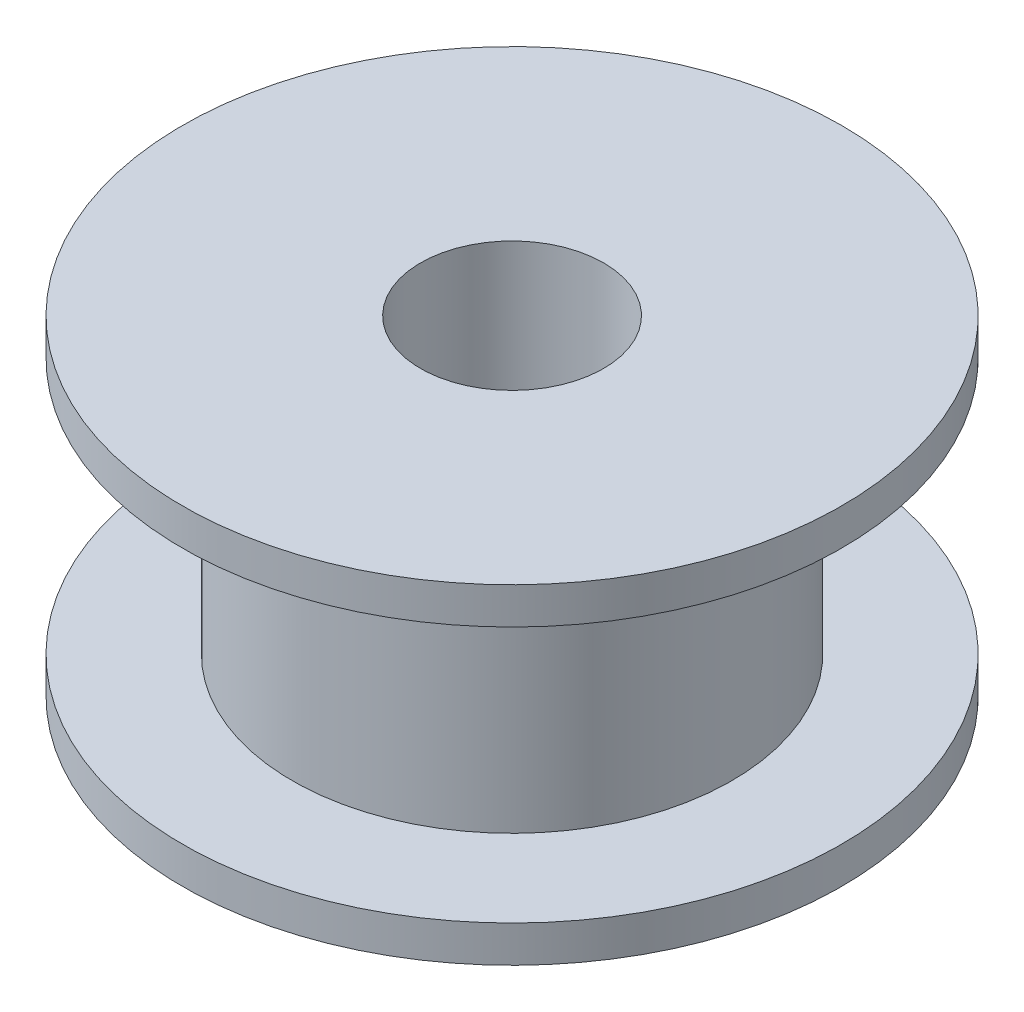
ISO-10303-21;
HEADER;
FILE_DESCRIPTION(('STEP AP214'),'2;1');
FILE_NAME('part.step','',(''),(''),'','','');
FILE_SCHEMA(('AUTOMOTIVE_DESIGN { 1 0 10303 214 1 1 1 1 }'));
ENDSEC;
DATA;
#1=APPLICATION_CONTEXT('core data for automotive mechanical design processes');
#2=APPLICATION_PROTOCOL_DEFINITION('international standard','automotive_design',2000,#1);
#3=PRODUCT_CONTEXT('',#1,'mechanical');
#4=PRODUCT('Part','Part','',(#3));
#5=PRODUCT_RELATED_PRODUCT_CATEGORY('part','',(#4));
#6=PRODUCT_DEFINITION_FORMATION('','',#4);
#7=PRODUCT_DEFINITION_CONTEXT('part definition',#1,'design');
#8=PRODUCT_DEFINITION('design','',#6,#7);
#9=PRODUCT_DEFINITION_SHAPE('','',#8);
#10=(LENGTH_UNIT() NAMED_UNIT(*) SI_UNIT(.MILLI.,.METRE.));
#11=(NAMED_UNIT(*) PLANE_ANGLE_UNIT() SI_UNIT($,.RADIAN.));
#12=(NAMED_UNIT(*) SI_UNIT($,.STERADIAN.) SOLID_ANGLE_UNIT());
#13=UNCERTAINTY_MEASURE_WITH_UNIT(LENGTH_MEASURE(1.E-05),#10,'distance_accuracy_value','');
#14=(GEOMETRIC_REPRESENTATION_CONTEXT(3) GLOBAL_UNCERTAINTY_ASSIGNED_CONTEXT((#13)) GLOBAL_UNIT_ASSIGNED_CONTEXT((#10,
#11,#12)) REPRESENTATION_CONTEXT('',''));
#15=CARTESIAN_POINT('',(0.,0.,0.));
#16=DIRECTION('',(0.,0.,1.));
#17=DIRECTION('',(1.,0.,0.));
#18=AXIS2_PLACEMENT_3D('',#15,#16,#17);
#19=CARTESIAN_POINT('',(2.5,4.5,0.));
#20=DIRECTION('',(0.,1.,0.));
#21=DIRECTION('',(0.,0.,1.));
#22=AXIS2_PLACEMENT_3D('',#19,#20,#21);
#23=PLANE('',#22);
#24=CARTESIAN_POINT('',(0.,4.5,0.));
#25=DIRECTION('',(0.,-1.,0.));
#26=DIRECTION('',(0.,0.,-1.));
#27=AXIS2_PLACEMENT_3D('',#24,#25,#26);
#28=CIRCLE('',#27,2.5);
#29=CARTESIAN_POINT('',(0.,4.5,-2.5));
#30=VERTEX_POINT('',#29);
#31=EDGE_CURVE('E59',#30,#30,#28,.T.);
#32=ORIENTED_EDGE('',*,*,#31,.T.);
#33=EDGE_LOOP('',(#32));
#34=FACE_BOUND('',#33,.T.);
#35=CARTESIAN_POINT('',(0.,4.5,0.));
#36=DIRECTION('',(0.,-1.,0.));
#37=DIRECTION('',(0.,0.,-1.));
#38=AXIS2_PLACEMENT_3D('',#35,#36,#37);
#39=CIRCLE('',#38,9.);
#40=CARTESIAN_POINT('',(0.,4.5,-9.));
#41=VERTEX_POINT('',#40);
#42=EDGE_CURVE('E10',#41,#41,#39,.T.);
#43=ORIENTED_EDGE('',*,*,#42,.F.);
#44=EDGE_LOOP('',(#43));
#45=FACE_BOUND('',#44,.T.);
#46=ADVANCED_FACE('F31',(#34,#45),#23,.T.);
#47=CARTESIAN_POINT('',(0.,0.,0.));
#48=DIRECTION('',(0.,-1.,0.));
#49=DIRECTION('',(0.,0.,-1.));
#50=AXIS2_PLACEMENT_3D('',#47,#48,#49);
#51=CYLINDRICAL_SURFACE('',#50,9.);
#52=ORIENTED_EDGE('',*,*,#42,.T.);
#53=EDGE_LOOP('',(#52));
#54=FACE_BOUND('',#53,.T.);
#55=CARTESIAN_POINT('',(0.,3.5,0.));
#56=DIRECTION('',(0.,-1.,0.));
#57=DIRECTION('',(0.,0.,-1.));
#58=AXIS2_PLACEMENT_3D('',#55,#56,#57);
#59=CIRCLE('',#58,9.);
#60=CARTESIAN_POINT('',(0.,3.5,-9.));
#61=VERTEX_POINT('',#60);
#62=EDGE_CURVE('E37',#61,#61,#59,.T.);
#63=ORIENTED_EDGE('',*,*,#62,.F.);
#64=EDGE_LOOP('',(#63));
#65=FACE_BOUND('',#64,.T.);
#66=ADVANCED_FACE('F77',(#54,#65),#51,.T.);
#67=CARTESIAN_POINT('',(9.,3.5,0.));
#68=DIRECTION('',(0.,-1.,0.));
#69=DIRECTION('',(0.,0.,-1.));
#70=AXIS2_PLACEMENT_3D('',#67,#68,#69);
#71=PLANE('',#70);
#72=ORIENTED_EDGE('',*,*,#62,.T.);
#73=EDGE_LOOP('',(#72));
#74=FACE_BOUND('',#73,.T.);
#75=CARTESIAN_POINT('',(0.,3.5,0.));
#76=DIRECTION('',(0.,-1.,0.));
#77=DIRECTION('',(0.,0.,-1.));
#78=AXIS2_PLACEMENT_3D('',#75,#76,#77);
#79=CIRCLE('',#78,6.);
#80=CARTESIAN_POINT('',(0.,3.5,-6.));
#81=VERTEX_POINT('',#80);
#82=EDGE_CURVE('E41',#81,#81,#79,.T.);
#83=ORIENTED_EDGE('',*,*,#82,.F.);
#84=EDGE_LOOP('',(#83));
#85=FACE_BOUND('',#84,.T.);
#86=ADVANCED_FACE('F81',(#74,#85),#71,.T.);
#87=CARTESIAN_POINT('',(0.,0.,0.));
#88=DIRECTION('',(0.,-1.,0.));
#89=DIRECTION('',(0.,0.,-1.));
#90=AXIS2_PLACEMENT_3D('',#87,#88,#89);
#91=CYLINDRICAL_SURFACE('',#90,6.);
#92=ORIENTED_EDGE('',*,*,#82,.T.);
#93=EDGE_LOOP('',(#92));
#94=FACE_BOUND('',#93,.T.);
#95=CARTESIAN_POINT('',(0.,-3.5,0.));
#96=DIRECTION('',(0.,-1.,0.));
#97=DIRECTION('',(0.,0.,-1.));
#98=AXIS2_PLACEMENT_3D('',#95,#96,#97);
#99=CIRCLE('',#98,6.);
#100=CARTESIAN_POINT('',(0.,-3.5,-6.));
#101=VERTEX_POINT('',#100);
#102=EDGE_CURVE('E45',#101,#101,#99,.T.);
#103=ORIENTED_EDGE('',*,*,#102,.F.);
#104=EDGE_LOOP('',(#103));
#105=FACE_BOUND('',#104,.T.);
#106=ADVANCED_FACE('F85',(#94,#105),#91,.T.);
#107=CARTESIAN_POINT('',(9.,-3.5,0.));
#108=DIRECTION('',(0.,1.,0.));
#109=DIRECTION('',(0.,0.,1.));
#110=AXIS2_PLACEMENT_3D('',#107,#108,#109);
#111=PLANE('',#110);
#112=ORIENTED_EDGE('',*,*,#102,.T.);
#113=EDGE_LOOP('',(#112));
#114=FACE_BOUND('',#113,.T.);
#115=CARTESIAN_POINT('',(0.,-3.5,0.));
#116=DIRECTION('',(0.,-1.,0.));
#117=DIRECTION('',(0.,0.,-1.));
#118=AXIS2_PLACEMENT_3D('',#115,#116,#117);
#119=CIRCLE('',#118,9.);
#120=CARTESIAN_POINT('',(0.,-3.5,-9.));
#121=VERTEX_POINT('',#120);
#122=EDGE_CURVE('E50',#121,#121,#119,.T.);
#123=ORIENTED_EDGE('',*,*,#122,.F.);
#124=EDGE_LOOP('',(#123));
#125=FACE_BOUND('',#124,.T.);
#126=ADVANCED_FACE('F91',(#114,#125),#111,.T.);
#127=CARTESIAN_POINT('',(0.,0.,0.));
#128=DIRECTION('',(0.,-1.,0.));
#129=DIRECTION('',(0.,0.,-1.));
#130=AXIS2_PLACEMENT_3D('',#127,#128,#129);
#131=CYLINDRICAL_SURFACE('',#130,9.);
#132=ORIENTED_EDGE('',*,*,#122,.T.);
#133=EDGE_LOOP('',(#132));
#134=FACE_BOUND('',#133,.T.);
#135=CARTESIAN_POINT('',(0.,-4.5,0.));
#136=DIRECTION('',(0.,-1.,0.));
#137=DIRECTION('',(0.,0.,-1.));
#138=AXIS2_PLACEMENT_3D('',#135,#136,#137);
#139=CIRCLE('',#138,9.);
#140=CARTESIAN_POINT('',(0.,-4.5,-9.));
#141=VERTEX_POINT('',#140);
#142=EDGE_CURVE('E53',#141,#141,#139,.T.);
#143=ORIENTED_EDGE('',*,*,#142,.F.);
#144=EDGE_LOOP('',(#143));
#145=FACE_BOUND('',#144,.T.);
#146=ADVANCED_FACE('F73',(#134,#145),#131,.T.);
#147=CARTESIAN_POINT('',(2.5,-4.5,0.));
#148=DIRECTION('',(0.,-1.,0.));
#149=DIRECTION('',(0.,0.,-1.));
#150=AXIS2_PLACEMENT_3D('',#147,#148,#149);
#151=PLANE('',#150);
#152=ORIENTED_EDGE('',*,*,#142,.T.);
#153=EDGE_LOOP('',(#152));
#154=FACE_BOUND('',#153,.T.);
#155=CARTESIAN_POINT('',(0.,-4.5,0.));
#156=DIRECTION('',(0.,-1.,0.));
#157=DIRECTION('',(0.,0.,-1.));
#158=AXIS2_PLACEMENT_3D('',#155,#156,#157);
#159=CIRCLE('',#158,2.5);
#160=CARTESIAN_POINT('',(0.,-4.5,-2.5));
#161=VERTEX_POINT('',#160);
#162=EDGE_CURVE('E56',#161,#161,#159,.T.);
#163=ORIENTED_EDGE('',*,*,#162,.F.);
#164=EDGE_LOOP('',(#163));
#165=FACE_BOUND('',#164,.T.);
#166=ADVANCED_FACE('F67',(#154,#165),#151,.T.);
#167=CARTESIAN_POINT('',(0.,0.,0.));
#168=DIRECTION('',(0.,-1.,0.));
#169=DIRECTION('',(0.,0.,-1.));
#170=AXIS2_PLACEMENT_3D('',#167,#168,#169);
#171=CYLINDRICAL_SURFACE('',#170,2.5);
#172=ORIENTED_EDGE('',*,*,#162,.T.);
#173=EDGE_LOOP('',(#172));
#174=FACE_BOUND('',#173,.T.);
#175=ORIENTED_EDGE('',*,*,#31,.F.);
#176=EDGE_LOOP('',(#175));
#177=FACE_BOUND('',#176,.T.);
#178=ADVANCED_FACE('F65',(#174,#177),#171,.F.);
#179=CLOSED_SHELL('',(#46,#66,#86,#106,#126,#146,#166,#178));
#180=MANIFOLD_SOLID_BREP('B2',#179);
#181=ADVANCED_BREP_SHAPE_REPRESENTATION('',(#18,#180),#14);
#182=SHAPE_DEFINITION_REPRESENTATION(#9,#181);
ENDSEC;
END-ISO-10303-21;
